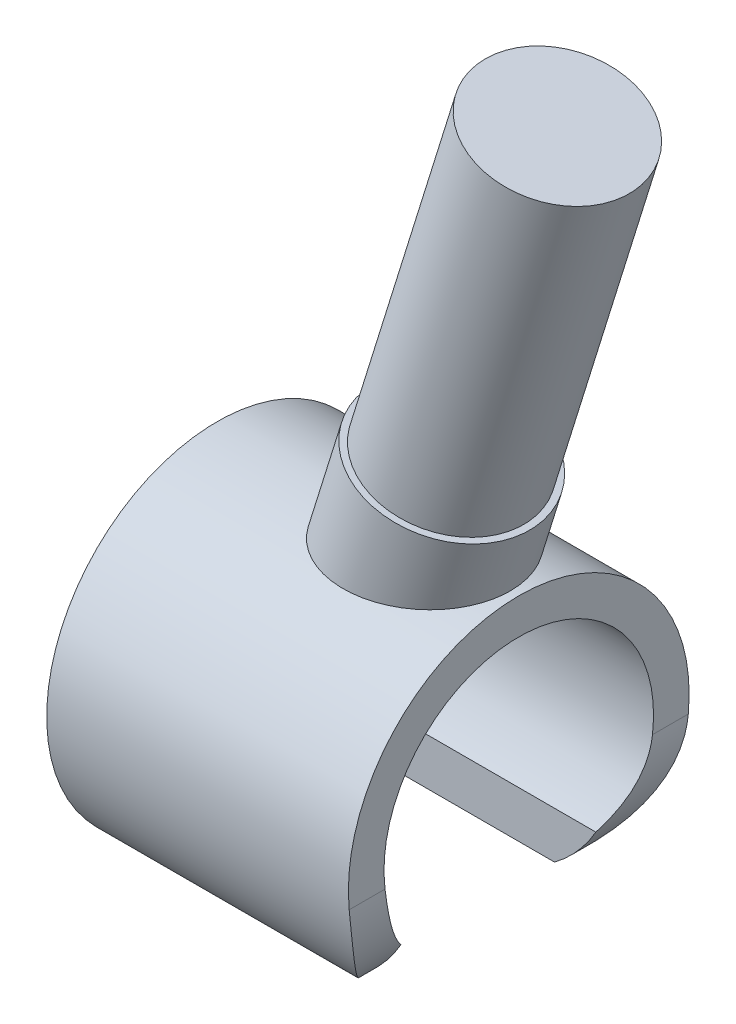
ISO-10303-21;
HEADER;
FILE_DESCRIPTION(('STEP AP214'),'2;1');
FILE_NAME('part.step','',(''),(''),'','','');
FILE_SCHEMA(('AUTOMOTIVE_DESIGN { 1 0 10303 214 1 1 1 1 }'));
ENDSEC;
DATA;
#1=APPLICATION_CONTEXT('core data for automotive mechanical design processes');
#2=APPLICATION_PROTOCOL_DEFINITION('international standard','automotive_design',2000,#1);
#3=PRODUCT_CONTEXT('',#1,'mechanical');
#4=PRODUCT('Part','Part','',(#3));
#5=PRODUCT_RELATED_PRODUCT_CATEGORY('part','',(#4));
#6=PRODUCT_DEFINITION_FORMATION('','',#4);
#7=PRODUCT_DEFINITION_CONTEXT('part definition',#1,'design');
#8=PRODUCT_DEFINITION('design','',#6,#7);
#9=PRODUCT_DEFINITION_SHAPE('','',#8);
#10=(LENGTH_UNIT() NAMED_UNIT(*) SI_UNIT(.MILLI.,.METRE.));
#11=(NAMED_UNIT(*) PLANE_ANGLE_UNIT() SI_UNIT($,.RADIAN.));
#12=(NAMED_UNIT(*) SI_UNIT($,.STERADIAN.) SOLID_ANGLE_UNIT());
#13=UNCERTAINTY_MEASURE_WITH_UNIT(LENGTH_MEASURE(1.E-05),#10,'distance_accuracy_value','');
#14=(GEOMETRIC_REPRESENTATION_CONTEXT(3) GLOBAL_UNCERTAINTY_ASSIGNED_CONTEXT((#13)) GLOBAL_UNIT_ASSIGNED_CONTEXT((#10,
#11,#12)) REPRESENTATION_CONTEXT('',''));
#15=CARTESIAN_POINT('',(0.,0.,0.));
#16=DIRECTION('',(0.,0.,1.));
#17=DIRECTION('',(1.,0.,0.));
#18=AXIS2_PLACEMENT_3D('',#15,#16,#17);
#19=CARTESIAN_POINT('',(0.648682940787519,2.08396213181124,2.44));
#20=DIRECTION('',(-0.297208232354151,-0.954812686667349,0.));
#21=DIRECTION('',(0.954812686667349,-0.297208232354151,0.));
#22=AXIS2_PLACEMENT_3D('',#19,#20,#21);
#23=PLANE('',#22);
#24=CARTESIAN_POINT('',(3.35999987723748,1.23999960561244,0.));
#25=DIRECTION('',(0.297208232354149,0.95481268666735,0.));
#26=DIRECTION('',(-0.95481268666735,0.297208232354149,0.));
#27=AXIS2_PLACEMENT_3D('',#24,#25,#26);
#28=CIRCLE('',#27,1.08);
#29=CARTESIAN_POINT('',(2.32880217563674,1.56098449655492,0.));
#30=VERTEX_POINT('',#29);
#31=EDGE_CURVE('E151',#30,#30,#28,.T.);
#32=ORIENTED_EDGE('',*,*,#31,.F.);
#33=EDGE_LOOP('',(#32));
#34=FACE_BOUND('',#33,.T.);
#35=CARTESIAN_POINT('',(3.36000000000001,1.24,0.));
#36=DIRECTION('',(0.297208232354151,0.954812686667349,0.));
#37=DIRECTION('',(-0.954812686667349,0.297208232354151,0.));
#38=AXIS2_PLACEMENT_3D('',#35,#36,#37);
#39=CIRCLE('',#38,1.17);
#40=CARTESIAN_POINT('',(2.24286915659922,1.58773363185435,0.));
#41=VERTEX_POINT('',#40);
#42=EDGE_CURVE('E162',#41,#41,#39,.T.);
#43=ORIENTED_EDGE('',*,*,#42,.T.);
#44=EDGE_LOOP('',(#43));
#45=FACE_BOUND('',#44,.T.);
#46=ADVANCED_FACE('F143',(#34,#45),#23,.F.);
#47=CARTESIAN_POINT('',(2.16147390954052,6.94396213181124,2.44));
#48=DIRECTION('',(-0.297208232354149,-0.95481268666735,0.));
#49=DIRECTION('',(0.95481268666735,-0.297208232354149,0.));
#50=AXIS2_PLACEMENT_3D('',#47,#48,#49);
#51=PLANE('',#50);
#52=CARTESIAN_POINT('',(4.87279096875302,6.1,0.));
#53=DIRECTION('',(0.297208232354149,0.95481268666735,0.));
#54=DIRECTION('',(-0.95481268666735,0.297208232354149,0.));
#55=AXIS2_PLACEMENT_3D('',#52,#53,#54);
#56=CIRCLE('',#55,1.08);
#57=CARTESIAN_POINT('',(3.84159326715229,6.42098489094248,0.));
#58=VERTEX_POINT('',#57);
#59=EDGE_CURVE('E156',#58,#58,#56,.T.);
#60=ORIENTED_EDGE('',*,*,#59,.T.);
#61=EDGE_LOOP('',(#60));
#62=FACE_BOUND('',#61,.T.);
#63=ADVANCED_FACE('F177',(#62),#51,.F.);
#64=CARTESIAN_POINT('',(3.35999987723748,1.23999960561244,0.));
#65=DIRECTION('',(0.297208232354149,0.95481268666735,0.));
#66=DIRECTION('',(-0.95481268666735,0.297208232354149,0.));
#67=AXIS2_PLACEMENT_3D('',#64,#65,#66);
#68=CYLINDRICAL_SURFACE('',#67,1.08);
#69=ORIENTED_EDGE('',*,*,#59,.F.);
#70=EDGE_LOOP('',(#69));
#71=FACE_BOUND('',#70,.T.);
#72=ORIENTED_EDGE('',*,*,#31,.T.);
#73=EDGE_LOOP('',(#72));
#74=FACE_BOUND('',#73,.T.);
#75=ADVANCED_FACE('F172',(#71,#74),#68,.T.);
#76=CARTESIAN_POINT('',(3.08226069011445,0.347733273185479,0.));
#77=DIRECTION('',(0.297208232354151,0.954812686667349,0.));
#78=DIRECTION('',(-0.954812686667349,0.297208232354151,0.));
#79=AXIS2_PLACEMENT_3D('',#76,#77,#78);
#80=CYLINDRICAL_SURFACE('',#79,1.17);
#81=ORIENTED_EDGE('',*,*,#42,.F.);
#82=EDGE_LOOP('',(#81));
#83=FACE_BOUND('',#82,.T.);
#84=CARTESIAN_POINT('',(2.97402041126468,0.,0.));
#85=DIRECTION('',(0.,1.,0.));
#86=DIRECTION('',(1.,0.,0.));
#87=AXIS2_PLACEMENT_3D('',#84,#85,#86);
#88=ELLIPSE('',#87,1.22537123389482,1.17);
#89=CARTESIAN_POINT('',(4.1993916451595,0.,0.));
#90=VERTEX_POINT('',#89);
#91=EDGE_CURVE('E12',#90,#90,#88,.F.);
#92=ORIENTED_EDGE('',*,*,#91,.F.);
#93=EDGE_LOOP('',(#92));
#94=FACE_BOUND('',#93,.T.);
#95=ADVANCED_FACE('F169',(#83,#94),#80,.T.);
#96=CARTESIAN_POINT('',(5.90398867035376,0.,0.));
#97=DIRECTION('',(0.,1.,0.));
#98=DIRECTION('',(-1.,0.,0.));
#99=AXIS2_PLACEMENT_3D('',#96,#97,#98);
#100=PLANE('',#99);
#101=ORIENTED_EDGE('',*,*,#91,.T.);
#102=EDGE_LOOP('',(#101));
#103=FACE_BOUND('',#102,.T.);
#104=ADVANCED_FACE('F145',(#103),#100,.F.);
#105=CLOSED_SHELL('',(#46,#63,#75,#95,#104));
#106=MANIFOLD_SOLID_BREP('B2',#105);
#107=CARTESIAN_POINT('',(5.90398867035376,0.,-1.395));
#108=DIRECTION('',(0.,0.,-1.));
#109=DIRECTION('',(-1.,0.,0.));
#110=AXIS2_PLACEMENT_3D('',#107,#108,#109);
#111=PLANE('',#110);
#112=DIRECTION('',(-1.,0.,0.));
#113=VECTOR('',#112,1.);
#114=CARTESIAN_POINT('',(5.90398867035376,-4.44189285427567,-1.395));
#115=LINE('',#114,#113);
#116=CARTESIAN_POINT('',(3.43747241718843,-4.44189285427567,-1.395));
#117=VERTEX_POINT('',#116);
#118=CARTESIAN_POINT('',(0.,-4.44189285427567,-1.395));
#119=VERTEX_POINT('',#118);
#120=EDGE_CURVE('E319',#117,#119,#115,.T.);
#121=ORIENTED_EDGE('',*,*,#120,.F.);
#122=CARTESIAN_POINT('',(2.12,-2.68,-1.395));
#123=DIRECTION('',(0.,0.,-1.));
#124=DIRECTION('',(-1.,0.,0.));
#125=AXIS2_PLACEMENT_3D('',#122,#123,#124);
#126=CIRCLE('',#125,2.2);
#127=CARTESIAN_POINT('',(4.02885370564006,-3.77374472819951,-1.395));
#128=VERTEX_POINT('',#127);
#129=EDGE_CURVE('E329',#117,#128,#126,.F.);
#130=ORIENTED_EDGE('',*,*,#129,.T.);
#131=DIRECTION('',(-1.,0.,0.));
#132=VECTOR('',#131,1.);
#133=CARTESIAN_POINT('',(5.90398867035376,-3.77374472819951,-1.395));
#134=LINE('',#133,#132);
#135=CARTESIAN_POINT('',(0.,-3.77374472819951,-1.395));
#136=VERTEX_POINT('',#135);
#137=EDGE_CURVE('E467',#128,#136,#134,.T.);
#138=ORIENTED_EDGE('',*,*,#137,.T.);
#139=DIRECTION('',(0.,-1.,0.));
#140=VECTOR('',#139,1.);
#141=CARTESIAN_POINT('',(0.,0.,-1.395));
#142=LINE('',#141,#140);
#143=EDGE_CURVE('E331',#136,#119,#142,.T.);
#144=ORIENTED_EDGE('',*,*,#143,.T.);
#145=EDGE_LOOP('',(#121,#130,#138,#144));
#146=FACE_BOUND('',#145,.T.);
#147=ADVANCED_FACE('F267',(#146),#111,.F.);
#148=CARTESIAN_POINT('',(2.12,-2.68,2.44));
#149=DIRECTION('',(0.,0.,-1.));
#150=DIRECTION('',(-1.,0.,0.));
#151=AXIS2_PLACEMENT_3D('',#148,#149,#150);
#152=CYLINDRICAL_SURFACE('',#151,2.2);
#153=ORIENTED_EDGE('',*,*,#129,.F.);
#154=CARTESIAN_POINT('',(3.43747241718843,-4.44189285427567,-1.395));
#155=CARTESIAN_POINT('',(3.49384451432653,-4.39972249503471,-1.45549549000905));
#156=CARTESIAN_POINT('',(3.54902321108765,-4.35425683445882,-1.51491059300919));
#157=CARTESIAN_POINT('',(3.65642120404882,-4.25630306164214,-1.63109053210581));
#158=CARTESIAN_POINT('',(3.70862875444346,-4.20378950812011,-1.68784471154481));
#159=CARTESIAN_POINT('',(3.80986039334067,-4.09074794086705,-1.79860552569233));
#160=CARTESIAN_POINT('',(3.85882258838979,-4.03010831016714,-1.85255593176147));
#161=CARTESIAN_POINT('',(3.9515073362542,-3.90141735368876,-1.95567083875429));
#162=CARTESIAN_POINT('',(3.99523867786662,-3.83337883743893,-2.00484334058067));
#163=CARTESIAN_POINT('',(4.08272492858964,-3.67841211268171,-2.10468915161153));
#164=CARTESIAN_POINT('',(4.12538315690887,-3.59019951533433,-2.1543631963166));
#165=CARTESIAN_POINT('',(4.19940104449324,-3.40520226744132,-2.24330395060341));
#166=CARTESIAN_POINT('',(4.23085311497901,-3.30849633432992,-2.28265504103901));
#167=CARTESIAN_POINT('',(4.27635139444621,-3.12447546627015,-2.34368204302066));
#168=CARTESIAN_POINT('',(4.2924275682013,-3.03829043776654,-2.36721247845265));
#169=CARTESIAN_POINT('',(4.30881180740273,-2.90608034961593,-2.39550401891232));
#170=CARTESIAN_POINT('',(4.31298615055403,-2.86124955138878,-2.40379479663745));
#171=CARTESIAN_POINT('',(4.31858331898815,-2.77099592573568,-2.41787781239909));
#172=CARTESIAN_POINT('',(4.32000420818262,-2.72557270432496,-2.42366829013036));
#173=CARTESIAN_POINT('',(4.32,-2.68,-2.42816803372419));
#174=B_SPLINE_CURVE_WITH_KNOTS('',3,(#154,#155,#156,#157,#158,#159,#160,#161,#162,#163,#164,
#165,#166,#167,#168,#169,#170,#171,#172,#173),.UNSPECIFIED.,.F.,.F.,(4,2,2,2,2,2,2,2,2,4),(0.,
0.278493855897529,0.558021498046122,0.841882222058994,1.1252591011144,1.45358778236454,
1.77914257618023,2.05031307678758,2.18751910362578,2.32482157178554),.UNSPECIFIED.);
#175=CARTESIAN_POINT('',(4.32,-2.68,-2.42816803372419));
#176=VERTEX_POINT('',#175);
#177=EDGE_CURVE('E316',#117,#176,#174,.T.);
#178=ORIENTED_EDGE('',*,*,#177,.T.);
#179=DIRECTION('',(0.,0.,-1.));
#180=VECTOR('',#179,1.);
#181=CARTESIAN_POINT('',(4.32,-2.68,2.44));
#182=LINE('',#181,#180);
#183=CARTESIAN_POINT('',(4.32,-2.68,-1.91501958214531));
#184=VERTEX_POINT('',#183);
#185=EDGE_CURVE('E343',#184,#176,#182,.T.);
#186=ORIENTED_EDGE('',*,*,#185,.F.);
#187=CARTESIAN_POINT('',(4.02885370564006,-3.77374472819951,-1.395));
#188=CARTESIAN_POINT('',(4.04823566836095,-3.73991393005196,-1.4273354908597));
#189=CARTESIAN_POINT('',(4.06716631446066,-3.70479209931201,-1.4585676816648));
#190=CARTESIAN_POINT('',(4.10380908899775,-3.63193053992738,-1.518698497282));
#191=CARTESIAN_POINT('',(4.1215197575862,-3.59418777981935,-1.54759433330926));
#192=CARTESIAN_POINT('',(4.17250979781695,-3.4765668022023,-1.63085201961379));
#193=CARTESIAN_POINT('',(4.20337354119306,-3.39275709041175,-1.68133843767423));
#194=CARTESIAN_POINT('',(4.25209937153415,-3.22817184280369,-1.76379503036452));
#195=CARTESIAN_POINT('',(4.271161040194,-3.14854334372909,-1.79735191035768));
#196=CARTESIAN_POINT('',(4.30043104075602,-2.98431535906936,-1.85366789351361));
#197=CARTESIAN_POINT('',(4.31068399649017,-2.89974327502003,-1.87648115341141));
#198=CARTESIAN_POINT('',(4.31727625078786,-2.79169333418629,-1.89782165517028));
#199=CARTESIAN_POINT('',(4.31829430993704,-2.76945898652411,-1.9018070190758));
#200=CARTESIAN_POINT('',(4.31965577241291,-2.72483573195088,-1.90899893203181));
#201=CARTESIAN_POINT('',(4.31999892577429,-2.70244677085523,-1.91220519213992));
#202=CARTESIAN_POINT('',(4.32,-2.68,-1.91501958214531));
#203=B_SPLINE_CURVE_WITH_KNOTS('',3,(#187,#188,#189,#190,#191,#192,#193,#194,#195,#196,#197,
#198,#199,#200,#201,#202),.UNSPECIFIED.,.F.,.F.,(4,2,2,2,2,2,2,4),(0.,0.151892014431299,
0.303962737033099,0.610175269175972,0.874595372577956,1.1376679225946,1.20548722859144,
1.27333164814262),.UNSPECIFIED.);
#204=EDGE_CURVE('E335',#128,#184,#203,.T.);
#205=ORIENTED_EDGE('',*,*,#204,.F.);
#206=EDGE_LOOP('',(#153,#178,#186,#205));
#207=FACE_BOUND('',#206,.T.);
#208=ADVANCED_FACE('F334',(#207),#152,.T.);
#209=CARTESIAN_POINT('',(4.32,0.,2.44));
#210=DIRECTION('',(-1.,0.,0.));
#211=DIRECTION('',(0.,0.,1.));
#212=AXIS2_PLACEMENT_3D('',#209,#210,#211);
#213=PLANE('',#212);
#214=ORIENTED_EDGE('',*,*,#185,.T.);
#215=CARTESIAN_POINT('',(4.32,-2.44,0.));
#216=DIRECTION('',(-1.,0.,0.));
#217=DIRECTION('',(0.,0.,1.));
#218=AXIS2_PLACEMENT_3D('',#215,#216,#217);
#219=CIRCLE('',#218,2.44);
#220=CARTESIAN_POINT('',(4.32,-2.68,2.42816803372419));
#221=VERTEX_POINT('',#220);
#222=EDGE_CURVE('E322',#221,#176,#219,.T.);
#223=ORIENTED_EDGE('',*,*,#222,.F.);
#224=CARTESIAN_POINT('',(4.32,-2.68,1.91501958214531));
#225=VERTEX_POINT('',#224);
#226=EDGE_CURVE('E339',#221,#225,#182,.T.);
#227=ORIENTED_EDGE('',*,*,#226,.T.);
#228=CARTESIAN_POINT('',(4.32,-2.44,0.));
#229=DIRECTION('',(-1.,0.,0.));
#230=DIRECTION('',(0.,0.,1.));
#231=AXIS2_PLACEMENT_3D('',#228,#229,#230);
#232=CIRCLE('',#231,1.93);
#233=EDGE_CURVE('E336',#225,#184,#232,.T.);
#234=ORIENTED_EDGE('',*,*,#233,.T.);
#235=EDGE_LOOP('',(#214,#223,#227,#234));
#236=FACE_BOUND('',#235,.T.);
#237=ADVANCED_FACE('F366',(#236),#213,.F.);
#238=CARTESIAN_POINT('',(0.,0.,2.44));
#239=DIRECTION('',(1.,0.,0.));
#240=DIRECTION('',(0.,1.,0.));
#241=AXIS2_PLACEMENT_3D('',#238,#239,#240);
#242=PLANE('',#241);
#243=CARTESIAN_POINT('',(0.,-2.44,0.));
#244=DIRECTION('',(-1.,0.,0.));
#245=DIRECTION('',(0.,-1.,0.));
#246=AXIS2_PLACEMENT_3D('',#243,#244,#245);
#247=CIRCLE('',#246,2.44);
#248=CARTESIAN_POINT('',(0.,-4.44189285427567,1.395));
#249=VERTEX_POINT('',#248);
#250=EDGE_CURVE('E282',#249,#119,#247,.T.);
#251=ORIENTED_EDGE('',*,*,#250,.T.);
#252=ORIENTED_EDGE('',*,*,#143,.F.);
#253=CARTESIAN_POINT('',(0.,-2.44,0.));
#254=DIRECTION('',(-1.,0.,0.));
#255=DIRECTION('',(0.,-1.,0.));
#256=AXIS2_PLACEMENT_3D('',#253,#254,#255);
#257=CIRCLE('',#256,1.93);
#258=CARTESIAN_POINT('',(0.,-3.77374472819951,1.395));
#259=VERTEX_POINT('',#258);
#260=EDGE_CURVE('E458',#259,#136,#257,.T.);
#261=ORIENTED_EDGE('',*,*,#260,.F.);
#262=DIRECTION('',(0.,-1.,0.));
#263=VECTOR('',#262,1.);
#264=CARTESIAN_POINT('',(0.,0.,1.395));
#265=LINE('',#264,#263);
#266=EDGE_CURVE('E463',#259,#249,#265,.T.);
#267=ORIENTED_EDGE('',*,*,#266,.T.);
#268=EDGE_LOOP('',(#251,#252,#261,#267));
#269=FACE_BOUND('',#268,.T.);
#270=ADVANCED_FACE('F269',(#269),#242,.F.);
#271=CARTESIAN_POINT('',(5.90398867035376,-2.44,0.));
#272=DIRECTION('',(-1.,0.,0.));
#273=DIRECTION('',(0.,-1.,0.));
#274=AXIS2_PLACEMENT_3D('',#271,#272,#273);
#275=CYLINDRICAL_SURFACE('',#274,1.93);
#276=CARTESIAN_POINT('',(4.32,-2.68,1.91501958214531));
#277=CARTESIAN_POINT('',(4.3200110383517,-2.72651987495302,1.90920055204811));
#278=CARTESIAN_POINT('',(4.31852494154973,-2.77281082631677,1.90166688594014));
#279=CARTESIAN_POINT('',(4.3127267265562,-2.86451355763498,1.8833112910794));
#280=CARTESIAN_POINT('',(4.30841722951678,-2.90992611284516,1.8724924171989));
#281=CARTESIAN_POINT('',(4.29717951324535,-2.99922335008666,1.84778330497768));
#282=CARTESIAN_POINT('',(4.29026991937615,-3.04311652965536,1.83391519633605));
#283=CARTESIAN_POINT('',(4.27405724440078,-3.12940705863943,1.80325166461691));
#284=CARTESIAN_POINT('',(4.26475376246262,-3.17180415619803,1.78645575146066));
#285=CARTESIAN_POINT('',(4.23370106751822,-3.29605416689902,1.73211123991578));
#286=CARTESIAN_POINT('',(4.20875482372594,-3.37537103508703,1.69049150165312));
#287=CARTESIAN_POINT('',(4.15246544360084,-3.52590880307331,1.5979774209171));
#288=CARTESIAN_POINT('',(4.12111641576847,-3.59712215179217,1.54707454124638));
#289=CARTESIAN_POINT('',(4.07818280706652,-3.68298238370649,1.4766517662446));
#290=CARTESIAN_POINT('',(4.06850080690663,-3.70165424070377,1.46072867092987));
#291=CARTESIAN_POINT('',(4.04887071361625,-3.73824722287416,1.42830308795676));
#292=CARTESIAN_POINT('',(4.03892334523239,-3.75617010609071,1.41180214620673));
#293=CARTESIAN_POINT('',(4.02885370564006,-3.77374472819957,1.39500000000007));
#294=B_SPLINE_CURVE_WITH_KNOTS('',3,(#276,#277,#278,#279,#280,#281,#282,#283,#284,#285,#286,
#287,#288,#289,#290,#291,#292,#293),.UNSPECIFIED.,.F.,.F.,(4,2,2,2,2,2,2,2,4),(0.,
0.140570483314751,0.281010650176194,0.420463377651616,0.559939470266111,0.837634412599806,
1.11558603554522,1.19471629941912,1.27364898883126),.UNSPECIFIED.);
#295=CARTESIAN_POINT('',(4.02885370564006,-3.77374472819951,1.395));
#296=VERTEX_POINT('',#295);
#297=EDGE_CURVE('E344',#225,#296,#294,.T.);
#298=ORIENTED_EDGE('',*,*,#297,.T.);
#299=DIRECTION('',(-1.,0.,0.));
#300=VECTOR('',#299,1.);
#301=CARTESIAN_POINT('',(5.90398867035376,-3.77374472819951,1.395));
#302=LINE('',#301,#300);
#303=EDGE_CURVE('E468',#296,#259,#302,.T.);
#304=ORIENTED_EDGE('',*,*,#303,.T.);
#305=ORIENTED_EDGE('',*,*,#260,.T.);
#306=ORIENTED_EDGE('',*,*,#137,.F.);
#307=ORIENTED_EDGE('',*,*,#204,.T.);
#308=ORIENTED_EDGE('',*,*,#233,.F.);
#309=EDGE_LOOP('',(#298,#304,#305,#306,#307,#308));
#310=FACE_BOUND('',#309,.T.);
#311=ADVANCED_FACE('F359',(#310),#275,.F.);
#312=ORIENTED_EDGE('',*,*,#226,.F.);
#313=CARTESIAN_POINT('',(4.32,-2.68,2.42816803372419));
#314=CARTESIAN_POINT('',(4.32001245712558,-2.73275527523629,2.42296703867854));
#315=CARTESIAN_POINT('',(4.31810297188493,-2.7853224135835,2.41602248460914));
#316=CARTESIAN_POINT('',(4.31061314602067,-2.88959165202358,2.39879959571323));
#317=CARTESIAN_POINT('',(4.30503642344894,-2.94129455326147,2.38852455176906));
#318=CARTESIAN_POINT('',(4.29045321946937,-3.04297312590179,2.36489453936517));
#319=CARTESIAN_POINT('',(4.2814793976953,-3.09296044920665,2.35156936263287));
#320=CARTESIAN_POINT('',(4.26033656034399,-3.19136604322801,2.32200176704426));
#321=CARTESIAN_POINT('',(4.24816689248192,-3.23978399135979,2.30575875285987));
#322=CARTESIAN_POINT('',(4.20735312643345,-3.38187014081784,2.25313782440485));
#323=CARTESIAN_POINT('',(4.17433119100991,-3.47285273389022,2.21275301185083));
#324=CARTESIAN_POINT('',(4.09870869618221,-3.64629181345281,2.1232165449132));
#325=CARTESIAN_POINT('',(4.0560791895473,-3.72872141058685,2.0740384913469));
#326=CARTESIAN_POINT('',(3.94151014541641,-3.92089011951145,1.94411812291397));
#327=CARTESIAN_POINT('',(3.86519677062749,-4.02532607812519,1.85938360807574));
#328=CARTESIAN_POINT('',(3.70144194735537,-4.21451330106838,1.67980830002582));
#329=CARTESIAN_POINT('',(3.61400072851922,-4.29926497152363,1.58496771538124));
#330=CARTESIAN_POINT('',(3.49469269550404,-4.39800405375382,1.4564563058754));
#331=CARTESIAN_POINT('',(3.46623503107556,-4.42037994232766,1.42586552224248));
#332=CARTESIAN_POINT('',(3.43747241718843,-4.44189285427567,1.395));
#333=B_SPLINE_CURVE_WITH_KNOTS('',3,(#313,#314,#315,#316,#317,#318,#319,#320,#321,#322,#323,
#324,#325,#326,#327,#328,#329,#330,#331,#332),.UNSPECIFIED.,.F.,.F.,(4,2,2,2,2,2,2,2,2,4),(0.,
0.15894555627742,0.317734533589626,0.475034167728091,0.632365932330699,0.945546010435297,
1.25968261083433,1.72102368209587,2.18235523413285,2.32448634155917),.UNSPECIFIED.);
#334=CARTESIAN_POINT('',(3.43747241718843,-4.44189285427567,1.395));
#335=VERTEX_POINT('',#334);
#336=EDGE_CURVE('E445',#221,#335,#333,.T.);
#337=ORIENTED_EDGE('',*,*,#336,.T.);
#338=CARTESIAN_POINT('',(2.12,-2.68,1.395));
#339=DIRECTION('',(0.,0.,-1.));
#340=DIRECTION('',(-1.,0.,0.));
#341=AXIS2_PLACEMENT_3D('',#338,#339,#340);
#342=CIRCLE('',#341,2.2);
#343=EDGE_CURVE('E275',#335,#296,#342,.F.);
#344=ORIENTED_EDGE('',*,*,#343,.T.);
#345=ORIENTED_EDGE('',*,*,#297,.F.);
#346=EDGE_LOOP('',(#312,#337,#344,#345));
#347=FACE_BOUND('',#346,.T.);
#348=ADVANCED_FACE('F363',(#347),#152,.T.);
#349=CARTESIAN_POINT('',(5.90398867035376,0.,1.395));
#350=DIRECTION('',(0.,0.,-1.));
#351=DIRECTION('',(-1.,0.,0.));
#352=AXIS2_PLACEMENT_3D('',#349,#350,#351);
#353=PLANE('',#352);
#354=ORIENTED_EDGE('',*,*,#343,.F.);
#355=DIRECTION('',(-1.,0.,0.));
#356=VECTOR('',#355,1.);
#357=CARTESIAN_POINT('',(5.90398867035376,-4.44189285427567,1.395));
#358=LINE('',#357,#356);
#359=EDGE_CURVE('E141',#335,#249,#358,.T.);
#360=ORIENTED_EDGE('',*,*,#359,.T.);
#361=ORIENTED_EDGE('',*,*,#266,.F.);
#362=ORIENTED_EDGE('',*,*,#303,.F.);
#363=EDGE_LOOP('',(#354,#360,#361,#362));
#364=FACE_BOUND('',#363,.T.);
#365=ADVANCED_FACE('F403',(#364),#353,.T.);
#366=CARTESIAN_POINT('',(5.90398867035376,-2.44,0.));
#367=DIRECTION('',(-1.,0.,0.));
#368=DIRECTION('',(0.,-1.,0.));
#369=AXIS2_PLACEMENT_3D('',#366,#367,#368);
#370=CYLINDRICAL_SURFACE('',#369,2.44);
#371=ORIENTED_EDGE('',*,*,#250,.F.);
#372=ORIENTED_EDGE('',*,*,#359,.F.);
#373=ORIENTED_EDGE('',*,*,#336,.F.);
#374=ORIENTED_EDGE('',*,*,#222,.T.);
#375=ORIENTED_EDGE('',*,*,#177,.F.);
#376=ORIENTED_EDGE('',*,*,#120,.T.);
#377=EDGE_LOOP('',(#371,#372,#373,#374,#375,#376));
#378=FACE_BOUND('',#377,.T.);
#379=ADVANCED_FACE('F318',(#378),#370,.T.);
#380=CLOSED_SHELL('',(#147,#208,#237,#270,#311,#348,#365,#379));
#381=MANIFOLD_SOLID_BREP('B7',#380);
#382=ADVANCED_BREP_SHAPE_REPRESENTATION('',(#18,#106,#381),#14);
#383=SHAPE_DEFINITION_REPRESENTATION(#9,#382);
ENDSEC;
END-ISO-10303-21;
